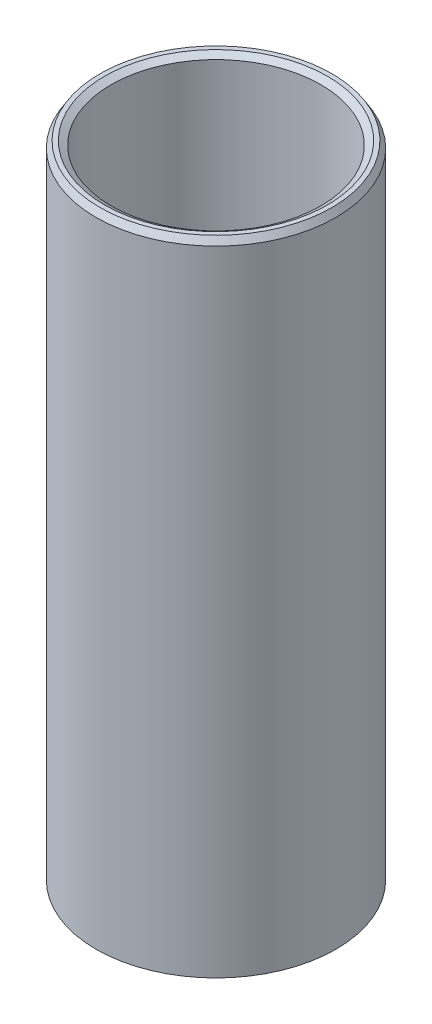
ISO-10303-21;
HEADER;
FILE_DESCRIPTION(('STEP AP214'),'2;1');
FILE_NAME('part.step','',(''),(''),'','','');
FILE_SCHEMA(('AUTOMOTIVE_DESIGN { 1 0 10303 214 1 1 1 1 }'));
ENDSEC;
DATA;
#1=APPLICATION_CONTEXT('core data for automotive mechanical design processes');
#2=APPLICATION_PROTOCOL_DEFINITION('international standard','automotive_design',2000,#1);
#3=PRODUCT_CONTEXT('',#1,'mechanical');
#4=PRODUCT('Part','Part','',(#3));
#5=PRODUCT_RELATED_PRODUCT_CATEGORY('part','',(#4));
#6=PRODUCT_DEFINITION_FORMATION('','',#4);
#7=PRODUCT_DEFINITION_CONTEXT('part definition',#1,'design');
#8=PRODUCT_DEFINITION('design','',#6,#7);
#9=PRODUCT_DEFINITION_SHAPE('','',#8);
#10=(LENGTH_UNIT() NAMED_UNIT(*) SI_UNIT(.MILLI.,.METRE.));
#11=(NAMED_UNIT(*) PLANE_ANGLE_UNIT() SI_UNIT($,.RADIAN.));
#12=(NAMED_UNIT(*) SI_UNIT($,.STERADIAN.) SOLID_ANGLE_UNIT());
#13=UNCERTAINTY_MEASURE_WITH_UNIT(LENGTH_MEASURE(1.E-05),#10,'distance_accuracy_value','');
#14=(GEOMETRIC_REPRESENTATION_CONTEXT(3) GLOBAL_UNCERTAINTY_ASSIGNED_CONTEXT((#13)) GLOBAL_UNIT_ASSIGNED_CONTEXT((#10,
#11,#12)) REPRESENTATION_CONTEXT('',''));
#15=CARTESIAN_POINT('',(0.,0.,0.));
#16=DIRECTION('',(0.,0.,1.));
#17=DIRECTION('',(1.,0.,0.));
#18=AXIS2_PLACEMENT_3D('',#15,#16,#17);
#19=CARTESIAN_POINT('',(0.,214.823332465492,0.));
#20=DIRECTION('',(0.,-1.,0.));
#21=DIRECTION('',(0.,0.,-1.));
#22=AXIS2_PLACEMENT_3D('',#19,#20,#21);
#23=CYLINDRICAL_SURFACE('',#22,40.);
#24=CARTESIAN_POINT('',(0.,1.34622445159699,0.));
#25=DIRECTION('',(0.,1.,0.));
#26=DIRECTION('',(0.,0.,1.));
#27=AXIS2_PLACEMENT_3D('',#24,#25,#26);
#28=CIRCLE('',#27,40.);
#29=CARTESIAN_POINT('',(0.,1.34622445159699,40.));
#30=VERTEX_POINT('',#29);
#31=EDGE_CURVE('E10',#30,#30,#28,.T.);
#32=ORIENTED_EDGE('',*,*,#31,.T.);
#33=EDGE_LOOP('',(#32));
#34=FACE_BOUND('',#33,.T.);
#35=CARTESIAN_POINT('',(0.,212.639936554112,0.));
#36=DIRECTION('',(0.,1.,0.));
#37=DIRECTION('',(0.,0.,1.));
#38=AXIS2_PLACEMENT_3D('',#35,#36,#37);
#39=CIRCLE('',#38,40.);
#40=CARTESIAN_POINT('',(0.,212.639936554112,40.));
#41=VERTEX_POINT('',#40);
#42=EDGE_CURVE('E50',#41,#41,#39,.F.);
#43=ORIENTED_EDGE('',*,*,#42,.T.);
#44=EDGE_LOOP('',(#43));
#45=FACE_BOUND('',#44,.T.);
#46=ADVANCED_FACE('F39',(#34,#45),#23,.T.);
#47=CARTESIAN_POINT('',(0.,214.823332465492,0.));
#48=DIRECTION('',(0.,1.,0.));
#49=DIRECTION('',(0.,0.,1.));
#50=AXIS2_PLACEMENT_3D('',#47,#48,#49);
#51=PLANE('',#50);
#52=CARTESIAN_POINT('',(0.,214.823332465492,0.));
#53=DIRECTION('',(0.,1.,0.));
#54=DIRECTION('',(0.,0.,1.));
#55=AXIS2_PLACEMENT_3D('',#52,#53,#54);
#56=CIRCLE('',#55,37.1715813140993);
#57=CARTESIAN_POINT('',(0.,214.823332465492,37.1715813140993));
#58=VERTEX_POINT('',#57);
#59=EDGE_CURVE('E58',#58,#58,#56,.F.);
#60=ORIENTED_EDGE('',*,*,#59,.T.);
#61=EDGE_LOOP('',(#60));
#62=FACE_BOUND('',#61,.T.);
#63=CARTESIAN_POINT('',(0.,214.823332465492,0.));
#64=DIRECTION('',(0.,1.,0.));
#65=DIRECTION('',(0.,0.,1.));
#66=AXIS2_PLACEMENT_3D('',#63,#64,#65);
#67=CIRCLE('',#66,38.653775548403);
#68=CARTESIAN_POINT('',(0.,214.823332465492,38.653775548403));
#69=VERTEX_POINT('',#68);
#70=EDGE_CURVE('E61',#69,#69,#67,.T.);
#71=ORIENTED_EDGE('',*,*,#70,.T.);
#72=EDGE_LOOP('',(#71));
#73=FACE_BOUND('',#72,.T.);
#74=ADVANCED_FACE('F88',(#62,#73),#51,.T.);
#75=CARTESIAN_POINT('',(0.,0.,0.));
#76=DIRECTION('',(0.,1.,0.));
#77=DIRECTION('',(0.,0.,1.));
#78=AXIS2_PLACEMENT_3D('',#75,#76,#77);
#79=PLANE('',#78);
#80=CARTESIAN_POINT('',(0.,0.,0.));
#81=DIRECTION('',(0.,1.,0.));
#82=DIRECTION('',(0.,0.,1.));
#83=AXIS2_PLACEMENT_3D('',#80,#81,#82);
#84=CIRCLE('',#83,36.334409854316);
#85=CARTESIAN_POINT('',(0.,0.,36.334409854316));
#86=VERTEX_POINT('',#85);
#87=EDGE_CURVE('E51',#86,#86,#84,.T.);
#88=ORIENTED_EDGE('',*,*,#87,.T.);
#89=EDGE_LOOP('',(#88));
#90=FACE_BOUND('',#89,.T.);
#91=CARTESIAN_POINT('',(0.,0.,0.));
#92=DIRECTION('',(0.,1.,0.));
#93=DIRECTION('',(0.,0.,1.));
#94=AXIS2_PLACEMENT_3D('',#91,#92,#93);
#95=CIRCLE('',#94,37.8166040886197);
#96=CARTESIAN_POINT('',(0.,0.,37.8166040886197));
#97=VERTEX_POINT('',#96);
#98=EDGE_CURVE('E54',#97,#97,#95,.F.);
#99=ORIENTED_EDGE('',*,*,#98,.T.);
#100=EDGE_LOOP('',(#99));
#101=FACE_BOUND('',#100,.T.);
#102=ADVANCED_FACE('F83',(#90,#101),#79,.F.);
#103=CARTESIAN_POINT('',(0.,214.823332465492,0.));
#104=DIRECTION('',(0.,-1.,0.));
#105=DIRECTION('',(0.,0.,-1.));
#106=AXIS2_PLACEMENT_3D('',#103,#104,#105);
#107=CYLINDRICAL_SURFACE('',#106,34.988185402719);
#108=CARTESIAN_POINT('',(0.,213.477108013895,0.));
#109=DIRECTION('',(0.,1.,0.));
#110=DIRECTION('',(0.,0.,1.));
#111=AXIS2_PLACEMENT_3D('',#108,#109,#110);
#112=CIRCLE('',#111,34.988185402719);
#113=CARTESIAN_POINT('',(0.,213.477108013895,34.988185402719));
#114=VERTEX_POINT('',#113);
#115=EDGE_CURVE('E67',#114,#114,#112,.T.);
#116=ORIENTED_EDGE('',*,*,#115,.T.);
#117=EDGE_LOOP('',(#116));
#118=FACE_BOUND('',#117,.T.);
#119=CARTESIAN_POINT('',(0.,2.18339591138028,0.));
#120=DIRECTION('',(0.,1.,0.));
#121=DIRECTION('',(0.,0.,1.));
#122=AXIS2_PLACEMENT_3D('',#119,#120,#121);
#123=CIRCLE('',#122,34.988185402719);
#124=CARTESIAN_POINT('',(0.,2.18339591138028,34.988185402719));
#125=VERTEX_POINT('',#124);
#126=EDGE_CURVE('E69',#125,#125,#123,.F.);
#127=ORIENTED_EDGE('',*,*,#126,.T.);
#128=EDGE_LOOP('',(#127));
#129=FACE_BOUND('',#128,.T.);
#130=ADVANCED_FACE('F71',(#118,#129),#107,.F.);
#131=CARTESIAN_POINT('',(0.,213.477108013895,0.));
#132=DIRECTION('',(0.,1.,0.));
#133=DIRECTION('',(0.,0.,1.));
#134=AXIS2_PLACEMENT_3D('',#131,#132,#133);
#135=CONICAL_SURFACE('',#134,34.988185402719,1.01827934751102);
#136=ORIENTED_EDGE('',*,*,#59,.F.);
#137=EDGE_LOOP('',(#136));
#138=FACE_BOUND('',#137,.T.);
#139=ORIENTED_EDGE('',*,*,#115,.F.);
#140=EDGE_LOOP('',(#139));
#141=FACE_BOUND('',#140,.T.);
#142=ADVANCED_FACE('F77',(#138,#141),#135,.F.);
#143=CARTESIAN_POINT('',(0.,0.,0.));
#144=DIRECTION('',(0.,-1.,0.));
#145=DIRECTION('',(0.,0.,-1.));
#146=AXIS2_PLACEMENT_3D('',#143,#144,#145);
#147=CONICAL_SURFACE('',#146,36.334409854316,0.552516979283864);
#148=ORIENTED_EDGE('',*,*,#126,.F.);
#149=EDGE_LOOP('',(#148));
#150=FACE_BOUND('',#149,.T.);
#151=ORIENTED_EDGE('',*,*,#87,.F.);
#152=EDGE_LOOP('',(#151));
#153=FACE_BOUND('',#152,.T.);
#154=ADVANCED_FACE('F73',(#150,#153),#147,.F.);
#155=CARTESIAN_POINT('',(0.,1.34622445159699,0.));
#156=DIRECTION('',(0.,1.,0.));
#157=DIRECTION('',(0.,0.,1.));
#158=AXIS2_PLACEMENT_3D('',#155,#156,#157);
#159=CONICAL_SURFACE('',#158,40.,1.01827934751104);
#160=ORIENTED_EDGE('',*,*,#98,.F.);
#161=EDGE_LOOP('',(#160));
#162=FACE_BOUND('',#161,.T.);
#163=ORIENTED_EDGE('',*,*,#31,.F.);
#164=EDGE_LOOP('',(#163));
#165=FACE_BOUND('',#164,.T.);
#166=ADVANCED_FACE('F76',(#162,#165),#159,.T.);
#167=CARTESIAN_POINT('',(0.,214.823332465492,0.));
#168=DIRECTION('',(0.,-1.,0.));
#169=DIRECTION('',(0.,0.,-1.));
#170=AXIS2_PLACEMENT_3D('',#167,#168,#169);
#171=CONICAL_SURFACE('',#170,38.653775548403,0.552516979283864);
#172=ORIENTED_EDGE('',*,*,#42,.F.);
#173=EDGE_LOOP('',(#172));
#174=FACE_BOUND('',#173,.T.);
#175=ORIENTED_EDGE('',*,*,#70,.F.);
#176=EDGE_LOOP('',(#175));
#177=FACE_BOUND('',#176,.T.);
#178=ADVANCED_FACE('F45',(#174,#177),#171,.T.);
#179=CLOSED_SHELL('',(#46,#74,#102,#130,#142,#154,#166,#178));
#180=MANIFOLD_SOLID_BREP('B2',#179);
#181=ADVANCED_BREP_SHAPE_REPRESENTATION('',(#18,#180),#14);
#182=SHAPE_DEFINITION_REPRESENTATION(#9,#181);
ENDSEC;
END-ISO-10303-21;
